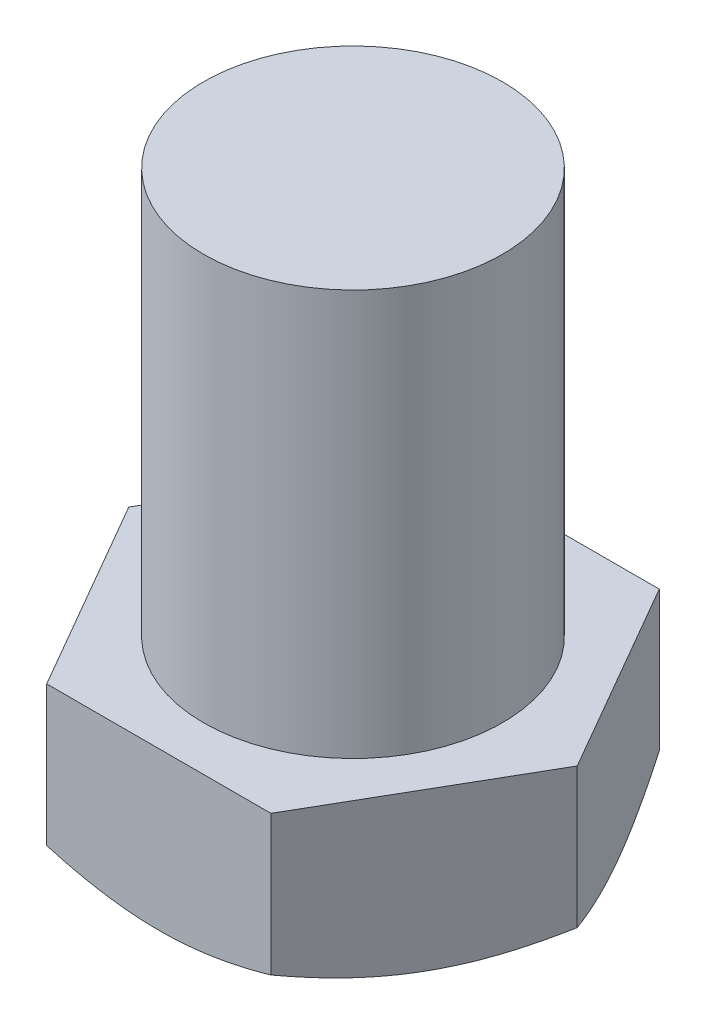
ISO-10303-21;
HEADER;
FILE_DESCRIPTION(('STEP AP214'),'2;1');
FILE_NAME('part.step','',(''),(''),'','','');
FILE_SCHEMA(('AUTOMOTIVE_DESIGN { 1 0 10303 214 1 1 1 1 }'));
ENDSEC;
DATA;
#1=APPLICATION_CONTEXT('core data for automotive mechanical design processes');
#2=APPLICATION_PROTOCOL_DEFINITION('international standard','automotive_design',2000,#1);
#3=PRODUCT_CONTEXT('',#1,'mechanical');
#4=PRODUCT('Part','Part','',(#3));
#5=PRODUCT_RELATED_PRODUCT_CATEGORY('part','',(#4));
#6=PRODUCT_DEFINITION_FORMATION('','',#4);
#7=PRODUCT_DEFINITION_CONTEXT('part definition',#1,'design');
#8=PRODUCT_DEFINITION('design','',#6,#7);
#9=PRODUCT_DEFINITION_SHAPE('','',#8);
#10=(LENGTH_UNIT() NAMED_UNIT(*) SI_UNIT(.MILLI.,.METRE.));
#11=(NAMED_UNIT(*) PLANE_ANGLE_UNIT() SI_UNIT($,.RADIAN.));
#12=(NAMED_UNIT(*) SI_UNIT($,.STERADIAN.) SOLID_ANGLE_UNIT());
#13=UNCERTAINTY_MEASURE_WITH_UNIT(LENGTH_MEASURE(1.E-05),#10,'distance_accuracy_value','');
#14=(GEOMETRIC_REPRESENTATION_CONTEXT(3) GLOBAL_UNCERTAINTY_ASSIGNED_CONTEXT((#13)) GLOBAL_UNIT_ASSIGNED_CONTEXT((#10,
#11,#12)) REPRESENTATION_CONTEXT('',''));
#15=CARTESIAN_POINT('',(0.,0.,0.));
#16=DIRECTION('',(0.,0.,1.));
#17=DIRECTION('',(1.,0.,0.));
#18=AXIS2_PLACEMENT_3D('',#15,#16,#17);
#19=CARTESIAN_POINT('',(5.25000000000011,8.,9.09326673973654));
#20=DIRECTION('',(-0.866025403784442,0.,-0.499999999999995));
#21=DIRECTION('',(-0.499999999999995,0.,0.866025403784442));
#22=AXIS2_PLACEMENT_3D('',#19,#20,#21);
#23=PLANE('',#22);
#24=CARTESIAN_POINT('',(10.5001154700538,1.44344234074043,-0.0002));
#25=CARTESIAN_POINT('',(10.3847280363974,1.37682687218532,0.199656897647865));
#26=CARTESIAN_POINT('',(10.2688905530427,1.31323405726124,0.400293304239121));
#27=CARTESIAN_POINT('',(10.0362748805198,1.19292776158243,0.803195467685742));
#28=CARTESIAN_POINT('',(9.91949630831816,1.13621725027232,1.00546188797426));
#29=CARTESIAN_POINT('',(9.68478175907643,1.03044427532811,1.41199941253658));
#30=CARTESIAN_POINT('',(9.56684370776388,0.981400088436956,1.61627410955557));
#31=CARTESIAN_POINT('',(9.33016546824959,0.89202116489814,2.02621284544028));
#32=CARTESIAN_POINT('',(9.21142544903797,0.851684649005117,2.23187659160653));
#33=CARTESIAN_POINT('',(8.97615382934937,0.781423048193364,2.63937899048619));
#34=CARTESIAN_POINT('',(8.85963960737029,0.751266603117255,2.84118754275833));
#35=CARTESIAN_POINT('',(8.62608983004945,0.700703866502197,3.24570762317442));
#36=CARTESIAN_POINT('',(8.50905432169238,0.680296713495569,3.44841906993852));
#37=CARTESIAN_POINT('',(8.27478030369215,0.649742299330548,3.85419357200824));
#38=CARTESIAN_POINT('',(8.15754217635836,0.639583394767521,4.05725596513459));
#39=CARTESIAN_POINT('',(7.92295802677138,0.629745271822186,4.46356763086958));
#40=CARTESIAN_POINT('',(7.80561200796367,0.63006572966396,4.66681689751046));
#41=CARTESIAN_POINT('',(7.58623013277257,0.640456828448158,5.0467974516012));
#42=CARTESIAN_POINT('',(7.48417880710043,0.649259919582375,5.2235555326451));
#43=CARTESIAN_POINT('',(7.28031519453202,0.674620648234135,5.57665766742814));
#44=CARTESIAN_POINT('',(7.17850292421381,0.691178808468231,5.7530016924532));
#45=CARTESIAN_POINT('',(6.87346026543448,0.752094464347212,6.28135107593491));
#46=CARTESIAN_POINT('',(6.67076981978894,0.807685527995083,6.63242122600177));
#47=CARTESIAN_POINT('',(6.26323886130116,0.946663846216747,7.33828555175986));
#48=CARTESIAN_POINT('',(6.05845035882324,1.03064021587855,7.69298964285756));
#49=CARTESIAN_POINT('',(5.65192725494666,1.22123175560358,8.39710831322241));
#50=CARTESIAN_POINT('',(5.45018744782168,1.32780216165882,8.74653190907203));
#51=CARTESIAN_POINT('',(5.24988452994627,1.44344234074043,9.09346673973655));
#52=B_SPLINE_CURVE_WITH_KNOTS('',3,(#24,#25,#26,#27,#28,#29,#30,#31,#32,#33,#34,#35,#36,#37,#38,
#39,#40,#41,#42,#43,#44,#45,#46,#47,#48,#49,#50,#51),.UNSPECIFIED.,.F.,.F.,(4,2,2,2,2,2,2,2,2,2,
2,2,2,4),(0.,0.720610237681786,1.44153029335,2.16414365920962,2.88660923285365,3.59133223973567,
4.29599296430742,4.99985219370005,5.70368967630656,6.31641406566495,6.9291797605591,
8.15558398123814,9.40918712315733,10.6603294175012),.UNSPECIFIED.);
#53=CARTESIAN_POINT('',(10.5,1.44337567297406,0.));
#54=VERTEX_POINT('',#53);
#55=CARTESIAN_POINT('',(5.25000000000011,1.44337567297406,9.09326673973654));
#56=VERTEX_POINT('',#55);
#57=EDGE_CURVE('E78',#54,#56,#52,.T.);
#58=ORIENTED_EDGE('',*,*,#57,.F.);
#59=DIRECTION('',(0.,-1.,0.));
#60=VECTOR('',#59,1.);
#61=CARTESIAN_POINT('',(10.5,8.,0.));
#62=LINE('',#61,#60);
#63=CARTESIAN_POINT('',(10.5,8.,0.));
#64=VERTEX_POINT('',#63);
#65=EDGE_CURVE('E65',#64,#54,#62,.T.);
#66=ORIENTED_EDGE('',*,*,#65,.F.);
#67=DIRECTION('',(0.499999999999995,0.,-0.866025403784441));
#68=VECTOR('',#67,1.);
#69=CARTESIAN_POINT('',(5.25000000000011,8.,9.09326673973654));
#70=LINE('',#69,#68);
#71=CARTESIAN_POINT('',(5.25000000000011,8.,9.09326673973654));
#72=VERTEX_POINT('',#71);
#73=EDGE_CURVE('E166',#72,#64,#70,.T.);
#74=ORIENTED_EDGE('',*,*,#73,.F.);
#75=DIRECTION('',(0.,-1.,0.));
#76=VECTOR('',#75,1.);
#77=CARTESIAN_POINT('',(5.25000000000011,8.,9.09326673973654));
#78=LINE('',#77,#76);
#79=EDGE_CURVE('E138',#72,#56,#78,.T.);
#80=ORIENTED_EDGE('',*,*,#79,.T.);
#81=EDGE_LOOP('',(#58,#66,#74,#80));
#82=FACE_BOUND('',#81,.T.);
#83=ADVANCED_FACE('F61',(#82),#23,.F.);
#84=CARTESIAN_POINT('',(10.5,8.,0.));
#85=DIRECTION('',(-0.866025403784438,0.,0.500000000000001));
#86=DIRECTION('',(0.500000000000001,0.,0.866025403784438));
#87=AXIS2_PLACEMENT_3D('',#84,#85,#86);
#88=PLANE('',#87);
#89=CARTESIAN_POINT('',(5.24988452994614,1.44344234074043,-9.09346673973662));
#90=CARTESIAN_POINT('',(5.36527196360254,1.37682687218532,-8.89360984208875));
#91=CARTESIAN_POINT('',(5.48110944695724,1.31323405726123,-8.6929734354975));
#92=CARTESIAN_POINT('',(5.71372511948023,1.19292776158243,-8.29007127205088));
#93=CARTESIAN_POINT('',(5.83050369168182,1.13621725027232,-8.08780485176237));
#94=CARTESIAN_POINT('',(6.06521824092356,1.03044427532811,-7.68126732720005));
#95=CARTESIAN_POINT('',(6.18315629223611,0.981400088436949,-7.47699263018106));
#96=CARTESIAN_POINT('',(6.4198345317504,0.892021164898131,-7.06705389429635));
#97=CARTESIAN_POINT('',(6.53857455096203,0.851684649005108,-6.8613901481301));
#98=CARTESIAN_POINT('',(6.77384617065062,0.781423048193353,-6.45388774925043));
#99=CARTESIAN_POINT('',(6.89036039262971,0.751266603117242,-6.2520791969783));
#100=CARTESIAN_POINT('',(7.12391016995055,0.700703866502182,-5.84755911656221));
#101=CARTESIAN_POINT('',(7.24094567830762,0.680296713495553,-5.64484766979811));
#102=CARTESIAN_POINT('',(7.47521969630786,0.64974229933053,-5.23907316772839));
#103=CARTESIAN_POINT('',(7.59245782364165,0.639583394767501,-5.03601077460205));
#104=CARTESIAN_POINT('',(7.82704197322863,0.629745271822165,-4.62969910886706));
#105=CARTESIAN_POINT('',(7.94438799203634,0.630065729663939,-4.42644984222618));
#106=CARTESIAN_POINT('',(8.16376986722744,0.640456828448135,-4.04646928813544));
#107=CARTESIAN_POINT('',(8.26582119289959,0.649259919582351,-3.86971120709153));
#108=CARTESIAN_POINT('',(8.46968480546801,0.674620648234111,-3.51660907230848));
#109=CARTESIAN_POINT('',(8.57149707578622,0.691178808468207,-3.34026504728342));
#110=CARTESIAN_POINT('',(8.87653973456556,0.752094464347189,-2.8119156638017));
#111=CARTESIAN_POINT('',(9.07923018021111,0.807685527995061,-2.46084551373483));
#112=CARTESIAN_POINT('',(9.4867611386989,0.946663846216729,-1.75498118797673));
#113=CARTESIAN_POINT('',(9.69154964117683,1.03064021587854,-1.40027709687902));
#114=CARTESIAN_POINT('',(10.0980727450534,1.22123175560357,-0.69615842651415));
#115=CARTESIAN_POINT('',(10.2998125521784,1.32780216165881,-0.346734830664524));
#116=CARTESIAN_POINT('',(10.5001154700538,1.44344234074043,0.000199999999999366));
#117=B_SPLINE_CURVE_WITH_KNOTS('',3,(#89,#90,#91,#92,#93,#94,#95,#96,#97,#98,#99,#100,#101,#102,
#103,#104,#105,#106,#107,#108,#109,#110,#111,#112,#113,#114,#115,#116),.UNSPECIFIED.,.F.,.F.,(4,
2,2,2,2,2,2,2,2,2,2,2,2,4),(0.,0.720610237681786,1.44153029335,2.16414365920961,
2.88660923285365,3.59133223973567,4.29599296430742,4.99985219370005,5.70368967630655,
6.31641406566497,6.92917976055912,8.15558398123821,9.40918712315743,10.6603294175013),.UNSPECIFIED.);
#118=CARTESIAN_POINT('',(5.24999999999998,1.44337567297406,-9.09326673973662));
#119=VERTEX_POINT('',#118);
#120=EDGE_CURVE('E162',#119,#54,#117,.T.);
#121=ORIENTED_EDGE('',*,*,#120,.F.);
#122=DIRECTION('',(0.,-1.,0.));
#123=VECTOR('',#122,1.);
#124=CARTESIAN_POINT('',(5.24999999999998,8.,-9.09326673973662));
#125=LINE('',#124,#123);
#126=CARTESIAN_POINT('',(5.24999999999998,8.,-9.09326673973662));
#127=VERTEX_POINT('',#126);
#128=EDGE_CURVE('E149',#127,#119,#125,.T.);
#129=ORIENTED_EDGE('',*,*,#128,.F.);
#130=DIRECTION('',(-0.500000000000001,0.,-0.866025403784438));
#131=VECTOR('',#130,1.);
#132=CARTESIAN_POINT('',(10.5,8.,0.));
#133=LINE('',#132,#131);
#134=EDGE_CURVE('E163',#64,#127,#133,.T.);
#135=ORIENTED_EDGE('',*,*,#134,.F.);
#136=ORIENTED_EDGE('',*,*,#65,.T.);
#137=EDGE_LOOP('',(#121,#129,#135,#136));
#138=FACE_BOUND('',#137,.T.);
#139=ADVANCED_FACE('F161',(#138),#88,.F.);
#140=CARTESIAN_POINT('',(5.24999999999998,8.,-9.09326673973662));
#141=DIRECTION('',(0.,0.,1.));
#142=DIRECTION('',(1.,0.,0.));
#143=AXIS2_PLACEMENT_3D('',#140,#141,#142);
#144=PLANE('',#143);
#145=CARTESIAN_POINT('',(-15.8568017177983,5.93464374055897,-9.09326673973655));
#146=CARTESIAN_POINT('',(-15.4777364124602,5.74482170590247,-9.09326673973655));
#147=CARTESIAN_POINT('',(-15.0980138564525,5.55629845755843,-9.09326673973655));
#148=CARTESIAN_POINT('',(-14.3369541703648,5.18247781066019,-9.09326673973655));
#149=CARTESIAN_POINT('',(-13.9556169353322,4.99718062592639,-9.09326673973655));
#150=CARTESIAN_POINT('',(-13.1903133591447,4.63009895014826,-9.09326673973656));
#151=CARTESIAN_POINT('',(-12.8063432853983,4.44832222463283,-9.09326673973656));
#152=CARTESIAN_POINT('',(-12.0361866852404,4.08953685039794,-9.09326673973656));
#153=CARTESIAN_POINT('',(-11.6500002020573,3.91252810906514,-9.09326673973656));
#154=CARTESIAN_POINT('',(-10.8574379772101,3.55649948222727,-9.09326673973657));
#155=CARTESIAN_POINT('',(-10.4509397690009,3.37775136706856,-9.09326673973657));
#156=CARTESIAN_POINT('',(-9.63445791129913,3.02831397181417,-9.09326673973657));
#157=CARTESIAN_POINT('',(-9.22447410744563,2.85762505083997,-9.09326673973657));
#158=CARTESIAN_POINT('',(-8.40062142990758,2.52660354932188,-9.09326673973657));
#159=CARTESIAN_POINT('',(-7.98675511514473,2.36626463059457,-9.09326673973657));
#160=CARTESIAN_POINT('',(-7.15417900917262,2.05870629750028,-9.09326673973658));
#161=CARTESIAN_POINT('',(-6.73546975238089,1.91148545087132,-9.09326673973658));
#162=CARTESIAN_POINT('',(-6.05438911677562,1.6872212183649,-9.09326673973658));
#163=CARTESIAN_POINT('',(-5.79374628503091,1.60494376218121,-9.09326673973658));
#164=CARTESIAN_POINT('',(-5.27022683837007,1.44784792754185,-9.09326673973658));
#165=CARTESIAN_POINT('',(-5.00735013956236,1.37302983057358,-9.09326673973658));
#166=CARTESIAN_POINT('',(-4.21519936295703,1.16151938941166,-9.09326673973658));
#167=CARTESIAN_POINT('',(-3.68229899487151,1.03773515583713,-9.09326673973659));
#168=CARTESIAN_POINT('',(-2.88122543782077,0.886549497272969,-9.09326673973659));
#169=CARTESIAN_POINT('',(-2.61621039594772,0.842142312210883,-9.09326673973659));
#170=CARTESIAN_POINT('',(-2.08442507158447,0.765313297557984,-9.09326673973659));
#171=CARTESIAN_POINT('',(-1.81765481972577,0.732891259366928,-9.09326673973659));
#172=CARTESIAN_POINT('',(-1.28294446976282,0.681010053298244,-9.0932667397366));
#173=CARTESIAN_POINT('',(-1.01500482588357,0.661546237177771,-9.0932667397366));
#174=CARTESIAN_POINT('',(-0.478477900411162,0.636194579917962,-9.0932667397366));
#175=CARTESIAN_POINT('',(-0.20989062180452,0.630306676293746,-9.0932667397366));
#176=CARTESIAN_POINT('',(0.328914518301501,0.63231383766897,-9.0932667397366));
#177=CARTESIAN_POINT('',(0.599132057780456,0.640295448199443,-9.0932667397366));
#178=CARTESIAN_POINT('',(1.13880835726805,0.669934728458221,-9.0932667397366));
#179=CARTESIAN_POINT('',(1.40826711390522,0.691592458857034,-9.0932667397366));
#180=CARTESIAN_POINT('',(1.94591810899649,0.747890203381434,-9.0932667397366));
#181=CARTESIAN_POINT('',(2.21410982944007,0.782535128464169,-9.09326673973661));
#182=CARTESIAN_POINT('',(2.74865727346096,0.863779241691202,-9.09326673973661));
#183=CARTESIAN_POINT('',(3.01501293258054,0.910378847349959,-9.09326673973661));
#184=CARTESIAN_POINT('',(3.81993504542777,1.06807554146351,-9.09326673973661));
#185=CARTESIAN_POINT('',(4.35524380949231,1.19604673827171,-9.09326673973661));
#186=CARTESIAN_POINT('',(5.15107921164002,1.41351118526861,-9.09326673973662));
#187=CARTESIAN_POINT('',(5.41525940850246,1.49028142442693,-9.09326673973662));
#188=CARTESIAN_POINT('',(5.94137656982224,1.65117159318865,-9.09326673973662));
#189=CARTESIAN_POINT('',(6.20331361897731,1.73529124393431,-9.09326673973662));
#190=CARTESIAN_POINT('',(6.87860515094579,1.96117826168478,-9.09326673973662));
#191=CARTESIAN_POINT('',(7.29035153222695,2.10773795819795,-9.09326673973662));
#192=CARTESIAN_POINT('',(8.10906886025213,2.41319627599115,-9.09326673973663));
#193=CARTESIAN_POINT('',(8.51604109413459,2.57209147924274,-9.09326673973663));
#194=CARTESIAN_POINT('',(9.32631868973301,2.89970939825599,-9.09326673973663));
#195=CARTESIAN_POINT('',(9.72962133176085,3.06843880977679,-9.09326673973663));
#196=CARTESIAN_POINT('',(10.5329347856138,3.41359619641427,-9.09326673973663));
#197=CARTESIAN_POINT('',(10.9329453919563,3.59002464782289,-9.09326673973664));
#198=CARTESIAN_POINT('',(11.7131335487981,3.94133815688118,-9.09326673973664));
#199=CARTESIAN_POINT('',(12.0934272222302,4.11596610527271,-9.09326673973664));
#200=CARTESIAN_POINT('',(12.8518671391847,4.46980104928979,-9.09326673973664));
#201=CARTESIAN_POINT('',(13.2300134160753,4.64900797352371,-9.09326673973664));
#202=CARTESIAN_POINT('',(13.9838118758652,5.01085039936679,-9.09326673973665));
#203=CARTESIAN_POINT('',(14.3594673450861,5.19347906866654,-9.09326673973665));
#204=CARTESIAN_POINT('',(15.1092285929885,5.56186571686167,-9.09326673973665));
#205=CARTESIAN_POINT('',(15.4833344152204,5.7476236070617,-9.09326673973665));
#206=CARTESIAN_POINT('',(15.8568017177982,5.93464374055897,-9.09326673973665));
#207=B_SPLINE_CURVE_WITH_KNOTS('',3,(#145,#146,#147,#148,#149,#150,#151,#152,#153,#154,#155,
#156,#157,#158,#159,#160,#161,#162,#163,#164,#165,#166,#167,#168,#169,#170,#171,#172,#173,#174,
#175,#176,#177,#178,#179,#180,#181,#182,#183,#184,#185,#186,#187,#188,#189,#190,#191,#192,#193,
#194,#195,#196,#197,#198,#199,#200,#201,#202,#203,#204,#205,#206),.UNSPECIFIED.,.F.,.F.,(4,2,2,
2,2,2,2,2,2,2,2,2,2,2,2,2,2,2,2,2,2,2,2,2,2,2,2,2,2,2,4),(0.,1.27181882794577,2.54372163236151,
3.81816792926679,5.09258945344864,6.42470930699005,7.75688846450623,9.088243920992,
10.4194538383845,11.2393092064373,12.059195500965,13.6986340933554,14.5045443141962,
15.3104405075923,16.1160474620452,16.9216507085812,17.7322989741067,18.5429508358853,
19.3539095459927,20.1648965825026,21.8142925353454,22.6395587217523,23.4647936087831,
24.7756792986225,26.0862030445968,27.3976297460598,28.709137692711,29.9645152450235,
31.2198732364494,32.4729468782191,33.7259850621419),.UNSPECIFIED.);
#208=CARTESIAN_POINT('',(-5.25000000000004,1.44337567297406,-9.09326673973658));
#209=VERTEX_POINT('',#208);
#210=EDGE_CURVE('E174',#209,#119,#207,.T.);
#211=ORIENTED_EDGE('',*,*,#210,.F.);
#212=DIRECTION('',(0.,-1.,0.));
#213=VECTOR('',#212,1.);
#214=CARTESIAN_POINT('',(-5.25000000000004,8.,-9.09326673973658));
#215=LINE('',#214,#213);
#216=CARTESIAN_POINT('',(-5.25000000000004,8.,-9.09326673973658));
#217=VERTEX_POINT('',#216);
#218=EDGE_CURVE('E142',#217,#209,#215,.T.);
#219=ORIENTED_EDGE('',*,*,#218,.F.);
#220=DIRECTION('',(-1.,0.,0.));
#221=VECTOR('',#220,1.);
#222=CARTESIAN_POINT('',(5.24999999999998,8.,-9.09326673973662));
#223=LINE('',#222,#221);
#224=EDGE_CURVE('E317',#127,#217,#223,.T.);
#225=ORIENTED_EDGE('',*,*,#224,.F.);
#226=ORIENTED_EDGE('',*,*,#128,.T.);
#227=EDGE_LOOP('',(#211,#219,#225,#226));
#228=FACE_BOUND('',#227,.T.);
#229=ADVANCED_FACE('F221',(#228),#144,.F.);
#230=CARTESIAN_POINT('',(-5.25000000000004,8.,-9.09326673973658));
#231=DIRECTION('',(0.866025403784441,0.,0.499999999999995));
#232=DIRECTION('',(0.499999999999995,0.,-0.866025403784442));
#233=AXIS2_PLACEMENT_3D('',#230,#231,#232);
#234=PLANE('',#233);
#235=CARTESIAN_POINT('',(-10.5001154700538,1.44344234074043,0.000200000000073321));
#236=CARTESIAN_POINT('',(-10.3847280363974,1.37682687218532,-0.19965689764779));
#237=CARTESIAN_POINT('',(-10.2688905530427,1.31323405726123,-0.400293304239046));
#238=CARTESIAN_POINT('',(-10.0362748805198,1.19292776158243,-0.803195467685668));
#239=CARTESIAN_POINT('',(-9.91949630831816,1.13621725027232,-1.00546188797418));
#240=CARTESIAN_POINT('',(-9.68478175907643,1.03044427532811,-1.4119994125365));
#241=CARTESIAN_POINT('',(-9.56684370776388,0.981400088436948,-1.61627410955549));
#242=CARTESIAN_POINT('',(-9.33016546824959,0.89202116489813,-2.0262128454402));
#243=CARTESIAN_POINT('',(-9.21142544903796,0.851684649005107,-2.23187659160645));
#244=CARTESIAN_POINT('',(-8.97615382934937,0.781423048193353,-2.63937899048612));
#245=CARTESIAN_POINT('',(-8.85963960737029,0.751266603117242,-2.84118754275825));
#246=CARTESIAN_POINT('',(-8.62608983004945,0.700703866502182,-3.24570762317435));
#247=CARTESIAN_POINT('',(-8.50905432169239,0.680296713495553,-3.44841906993844));
#248=CARTESIAN_POINT('',(-8.27478030369215,0.649742299330529,-3.85419357200816));
#249=CARTESIAN_POINT('',(-8.15754217635836,0.6395833947675,-4.05725596513451));
#250=CARTESIAN_POINT('',(-7.92295802677138,0.629745271822164,-4.46356763086951));
#251=CARTESIAN_POINT('',(-7.80561200796368,0.630065729663938,-4.66681689751039));
#252=CARTESIAN_POINT('',(-7.58623013277257,0.640456828448134,-5.04679745160112));
#253=CARTESIAN_POINT('',(-7.48417880710043,0.64925991958235,-5.22355553264503));
#254=CARTESIAN_POINT('',(-7.28031519453201,0.674620648234109,-5.57665766742808));
#255=CARTESIAN_POINT('',(-7.1785029242138,0.691178808468206,-5.75300169245315));
#256=CARTESIAN_POINT('',(-6.87346026543446,0.752094464347188,-6.28135107593487));
#257=CARTESIAN_POINT('',(-6.67076981978892,0.80768552799506,-6.63242122600174));
#258=CARTESIAN_POINT('',(-6.26323886130112,0.946663846216728,-7.33828555175985));
#259=CARTESIAN_POINT('',(-6.0584503588232,1.03064021587854,-7.69298964285756));
#260=CARTESIAN_POINT('',(-5.65192725494661,1.22123175560357,-8.39710831322243));
#261=CARTESIAN_POINT('',(-5.45018744782162,1.32780216165881,-8.74653190907206));
#262=CARTESIAN_POINT('',(-5.2498845299462,1.44344234074043,-9.09346673973658));
#263=B_SPLINE_CURVE_WITH_KNOTS('',3,(#235,#236,#237,#238,#239,#240,#241,#242,#243,#244,#245,
#246,#247,#248,#249,#250,#251,#252,#253,#254,#255,#256,#257,#258,#259,#260,#261,#262),
.UNSPECIFIED.,.F.,.F.,(4,2,2,2,2,2,2,2,2,2,2,2,2,4),(0.,0.720610237681786,1.44153029335,
2.16414365920961,2.88660923285365,3.59133223973567,4.29599296430742,4.99985219370005,
5.70368967630655,6.31641406566497,6.92917976055913,8.15558398123821,9.40918712315743,
10.6603294175013),.UNSPECIFIED.);
#264=CARTESIAN_POINT('',(-10.5,1.44337567297406,0.));
#265=VERTEX_POINT('',#264);
#266=EDGE_CURVE('E134',#265,#209,#263,.T.);
#267=ORIENTED_EDGE('',*,*,#266,.F.);
#268=DIRECTION('',(0.,-1.,0.));
#269=VECTOR('',#268,1.);
#270=CARTESIAN_POINT('',(-10.5,8.,0.));
#271=LINE('',#270,#269);
#272=CARTESIAN_POINT('',(-10.5,8.,0.));
#273=VERTEX_POINT('',#272);
#274=EDGE_CURVE('E132',#273,#265,#271,.T.);
#275=ORIENTED_EDGE('',*,*,#274,.F.);
#276=DIRECTION('',(-0.499999999999995,0.,0.866025403784441));
#277=VECTOR('',#276,1.);
#278=CARTESIAN_POINT('',(-5.25000000000004,8.,-9.09326673973658));
#279=LINE('',#278,#277);
#280=EDGE_CURVE('E318',#217,#273,#279,.T.);
#281=ORIENTED_EDGE('',*,*,#280,.F.);
#282=ORIENTED_EDGE('',*,*,#218,.T.);
#283=EDGE_LOOP('',(#267,#275,#281,#282));
#284=FACE_BOUND('',#283,.T.);
#285=ADVANCED_FACE('F224',(#284),#234,.F.);
#286=CARTESIAN_POINT('',(-10.5,8.,0.));
#287=DIRECTION('',(0.866025403784435,0.,-0.500000000000007));
#288=DIRECTION('',(-0.500000000000007,0.,-0.866025403784435));
#289=AXIS2_PLACEMENT_3D('',#286,#287,#288);
#290=PLANE('',#289);
#291=CARTESIAN_POINT('',(-5.24988452994608,1.44344234074043,9.09346673973666));
#292=CARTESIAN_POINT('',(-5.36527196360248,1.37682687218532,8.89360984208879));
#293=CARTESIAN_POINT('',(-5.48110944695718,1.31323405726124,8.69297343549754));
#294=CARTESIAN_POINT('',(-5.71372511948017,1.19292776158243,8.29007127205092));
#295=CARTESIAN_POINT('',(-5.83050369168177,1.13621725027232,8.08780485176241));
#296=CARTESIAN_POINT('',(-6.06521824092351,1.03044427532811,7.68126732720009));
#297=CARTESIAN_POINT('',(-6.18315629223605,0.981400088436949,7.4769926301811));
#298=CARTESIAN_POINT('',(-6.41983453175035,0.892021164898132,7.0670538942964));
#299=CARTESIAN_POINT('',(-6.53857455096198,0.851684649005109,6.86139014813015));
#300=CARTESIAN_POINT('',(-6.77384617065058,0.781423048193353,6.45388774925048));
#301=CARTESIAN_POINT('',(-6.89036039262967,0.751266603117242,6.25207919697835));
#302=CARTESIAN_POINT('',(-7.12391016995051,0.700703866502183,5.84755911656226));
#303=CARTESIAN_POINT('',(-7.24094567830758,0.680296713495554,5.64484766979817));
#304=CARTESIAN_POINT('',(-7.47521969630782,0.649742299330531,5.23907316772845));
#305=CARTESIAN_POINT('',(-7.59245782364161,0.639583394767501,5.0360107746021));
#306=CARTESIAN_POINT('',(-7.8270419732286,0.629745271822165,4.62969910886711));
#307=CARTESIAN_POINT('',(-7.9443879920363,0.630065729663939,4.42644984222623));
#308=CARTESIAN_POINT('',(-8.16376986722741,0.640456828448136,4.0464692881355));
#309=CARTESIAN_POINT('',(-8.26582119289956,0.649259919582351,3.86971120709159));
#310=CARTESIAN_POINT('',(-8.46968480546798,0.67462064823411,3.51660907230854));
#311=CARTESIAN_POINT('',(-8.57149707578619,0.691178808468207,3.34026504728348));
#312=CARTESIAN_POINT('',(-8.87653973456554,0.752094464347189,2.81191566380176));
#313=CARTESIAN_POINT('',(-9.07923018021109,0.80768552799506,2.4608455137349));
#314=CARTESIAN_POINT('',(-9.48676113869889,0.946663846216728,1.75498118797679));
#315=CARTESIAN_POINT('',(-9.69154964117682,1.03064021587853,1.40027709687908));
#316=CARTESIAN_POINT('',(-10.0980727450534,1.22123175560357,0.696158426514222));
#317=CARTESIAN_POINT('',(-10.2998125521784,1.32780216165881,0.346734830664597));
#318=CARTESIAN_POINT('',(-10.5001154700538,1.44344234074042,-0.000199999999925938));
#319=B_SPLINE_CURVE_WITH_KNOTS('',3,(#291,#292,#293,#294,#295,#296,#297,#298,#299,#300,#301,
#302,#303,#304,#305,#306,#307,#308,#309,#310,#311,#312,#313,#314,#315,#316,#317,#318),
.UNSPECIFIED.,.F.,.F.,(4,2,2,2,2,2,2,2,2,2,2,2,2,4),(0.,0.720610237681785,1.44153029335,
2.16414365920961,2.88660923285365,3.59133223973567,4.29599296430742,4.99985219370005,
5.70368967630655,6.31641406566497,6.92917976055913,8.15558398123821,9.40918712315743,
10.6603294175013),.UNSPECIFIED.);
#320=CARTESIAN_POINT('',(-5.24999999999992,1.44337567297406,9.09326673973665));
#321=VERTEX_POINT('',#320);
#322=EDGE_CURVE('E117',#321,#265,#319,.T.);
#323=ORIENTED_EDGE('',*,*,#322,.F.);
#324=DIRECTION('',(0.,-1.,0.));
#325=VECTOR('',#324,1.);
#326=CARTESIAN_POINT('',(-5.24999999999992,8.,9.09326673973665));
#327=LINE('',#326,#325);
#328=CARTESIAN_POINT('',(-5.24999999999992,8.,9.09326673973665));
#329=VERTEX_POINT('',#328);
#330=EDGE_CURVE('E130',#329,#321,#327,.T.);
#331=ORIENTED_EDGE('',*,*,#330,.F.);
#332=DIRECTION('',(0.500000000000007,0.,0.866025403784435));
#333=VECTOR('',#332,1.);
#334=CARTESIAN_POINT('',(-10.5,8.,0.));
#335=LINE('',#334,#333);
#336=EDGE_CURVE('E320',#273,#329,#335,.T.);
#337=ORIENTED_EDGE('',*,*,#336,.F.);
#338=ORIENTED_EDGE('',*,*,#274,.T.);
#339=EDGE_LOOP('',(#323,#331,#337,#338));
#340=FACE_BOUND('',#339,.T.);
#341=ADVANCED_FACE('F128',(#340),#290,.F.);
#342=CARTESIAN_POINT('',(-5.24999999999992,8.,9.09326673973665));
#343=DIRECTION('',(0.,0.,-1.));
#344=DIRECTION('',(-1.,0.,0.));
#345=AXIS2_PLACEMENT_3D('',#342,#343,#344);
#346=PLANE('',#345);
#347=CARTESIAN_POINT('',(15.8568017177983,5.93464374055897,9.09326673973643));
#348=CARTESIAN_POINT('',(15.4777364124603,5.74482170590247,9.09326673973643));
#349=CARTESIAN_POINT('',(15.0980138564525,5.55629845755843,9.09326673973644));
#350=CARTESIAN_POINT('',(14.3369541703649,5.18247781066019,9.09326673973645));
#351=CARTESIAN_POINT('',(13.9556169353323,4.99718062592639,9.09326673973645));
#352=CARTESIAN_POINT('',(13.1903133591448,4.63009895014826,9.09326673973646));
#353=CARTESIAN_POINT('',(12.8063432853984,4.44832222463283,9.09326673973646));
#354=CARTESIAN_POINT('',(12.0361866852404,4.08953685039794,9.09326673973647));
#355=CARTESIAN_POINT('',(11.6500002020574,3.91252810906514,9.09326673973648));
#356=CARTESIAN_POINT('',(10.8574379772102,3.55649948222727,9.09326673973649));
#357=CARTESIAN_POINT('',(10.4509397690009,3.37775136706856,9.09326673973649));
#358=CARTESIAN_POINT('',(9.6344579112992,3.02831397181417,9.0932667397365));
#359=CARTESIAN_POINT('',(9.2244741074457,2.85762505083997,9.0932667397365));
#360=CARTESIAN_POINT('',(8.40062142990765,2.52660354932188,9.09326673973651));
#361=CARTESIAN_POINT('',(7.9867551151448,2.36626463059457,9.09326673973651));
#362=CARTESIAN_POINT('',(7.15417900917269,2.05870629750028,9.09326673973652));
#363=CARTESIAN_POINT('',(6.73546975238096,1.91148545087132,9.09326673973653));
#364=CARTESIAN_POINT('',(6.05438911677569,1.6872212183649,9.09326673973653));
#365=CARTESIAN_POINT('',(5.79374628503098,1.60494376218122,9.09326673973654));
#366=CARTESIAN_POINT('',(5.27022683837014,1.44784792754185,9.09326673973654));
#367=CARTESIAN_POINT('',(5.00735013956243,1.37302983057358,9.09326673973655));
#368=CARTESIAN_POINT('',(4.2151993629571,1.16151938941166,9.09326673973655));
#369=CARTESIAN_POINT('',(3.68229899487158,1.03773515583713,9.09326673973656));
#370=CARTESIAN_POINT('',(2.88122543782084,0.886549497272969,9.09326673973657));
#371=CARTESIAN_POINT('',(2.61621039594779,0.842142312210882,9.09326673973657));
#372=CARTESIAN_POINT('',(2.08442507158454,0.765313297557984,9.09326673973658));
#373=CARTESIAN_POINT('',(1.81765481972584,0.732891259366928,9.09326673973658));
#374=CARTESIAN_POINT('',(1.28294446976288,0.681010053298244,9.09326673973658));
#375=CARTESIAN_POINT('',(1.01500482588364,0.661546237177771,9.09326673973659));
#376=CARTESIAN_POINT('',(0.478477900411229,0.636194579917962,9.09326673973659));
#377=CARTESIAN_POINT('',(0.209890621804588,0.630306676293745,9.0932667397366));
#378=CARTESIAN_POINT('',(-0.328914518301433,0.632313837668969,9.0932667397366));
#379=CARTESIAN_POINT('',(-0.599132057780388,0.640295448199443,9.0932667397366));
#380=CARTESIAN_POINT('',(-1.13880835726798,0.669934728458221,9.09326673973661));
#381=CARTESIAN_POINT('',(-1.40826711390515,0.691592458857034,9.09326673973661));
#382=CARTESIAN_POINT('',(-1.94591810899641,0.747890203381434,9.09326673973662));
#383=CARTESIAN_POINT('',(-2.21410982944,0.782535128464168,9.09326673973662));
#384=CARTESIAN_POINT('',(-2.74865727346089,0.8637792416912,9.09326673973663));
#385=CARTESIAN_POINT('',(-3.01501293258047,0.910378847349958,9.09326673973663));
#386=CARTESIAN_POINT('',(-3.8199350454277,1.06807554146351,9.09326673973664));
#387=CARTESIAN_POINT('',(-4.35524380949224,1.19604673827171,9.09326673973665));
#388=CARTESIAN_POINT('',(-5.15107921163995,1.41351118526861,9.09326673973665));
#389=CARTESIAN_POINT('',(-5.41525940850239,1.49028142442693,9.09326673973666));
#390=CARTESIAN_POINT('',(-5.94137656982217,1.65117159318865,9.09326673973666));
#391=CARTESIAN_POINT('',(-6.20331361897724,1.73529124393431,9.09326673973666));
#392=CARTESIAN_POINT('',(-6.87860515094572,1.96117826168478,9.09326673973667));
#393=CARTESIAN_POINT('',(-7.29035153222689,2.10773795819795,9.09326673973668));
#394=CARTESIAN_POINT('',(-8.10906886025207,2.41319627599115,9.09326673973669));
#395=CARTESIAN_POINT('',(-8.51604109413453,2.57209147924275,9.09326673973669));
#396=CARTESIAN_POINT('',(-9.32631868973294,2.89970939825599,9.0932667397367));
#397=CARTESIAN_POINT('',(-9.72962133176078,3.06843880977679,9.0932667397367));
#398=CARTESIAN_POINT('',(-10.5329347856137,3.41359619641427,9.09326673973671));
#399=CARTESIAN_POINT('',(-10.9329453919562,3.59002464782289,9.09326673973672));
#400=CARTESIAN_POINT('',(-11.713133548798,3.94133815688118,9.09326673973672));
#401=CARTESIAN_POINT('',(-12.0934272222302,4.11596610527272,9.09326673973673));
#402=CARTESIAN_POINT('',(-12.8518671391846,4.4698010492898,9.09326673973673));
#403=CARTESIAN_POINT('',(-13.2300134160752,4.64900797352372,9.09326673973674));
#404=CARTESIAN_POINT('',(-13.9838118758652,5.01085039936679,9.09326673973675));
#405=CARTESIAN_POINT('',(-14.359467345086,5.19347906866654,9.09326673973675));
#406=CARTESIAN_POINT('',(-15.1092285929884,5.56186571686168,9.09326673973676));
#407=CARTESIAN_POINT('',(-15.4833344152203,5.7476236070617,9.09326673973676));
#408=CARTESIAN_POINT('',(-15.8568017177982,5.93464374055897,9.09326673973677));
#409=B_SPLINE_CURVE_WITH_KNOTS('',3,(#347,#348,#349,#350,#351,#352,#353,#354,#355,#356,#357,
#358,#359,#360,#361,#362,#363,#364,#365,#366,#367,#368,#369,#370,#371,#372,#373,#374,#375,#376,
#377,#378,#379,#380,#381,#382,#383,#384,#385,#386,#387,#388,#389,#390,#391,#392,#393,#394,#395,
#396,#397,#398,#399,#400,#401,#402,#403,#404,#405,#406,#407,#408),.UNSPECIFIED.,.F.,.F.,(4,2,2,
2,2,2,2,2,2,2,2,2,2,2,2,2,2,2,2,2,2,2,2,2,2,2,2,2,2,2,4),(0.,1.27181882794578,2.54372163236151,
3.81816792926679,5.09258945344864,6.42470930699005,7.75688846450622,9.08824392099199,
10.4194538383845,11.2393092064373,12.059195500965,13.6986340933554,14.5045443141962,
15.3104405075923,16.1160474620452,16.9216507085812,17.7322989741067,18.5429508358853,
19.3539095459927,20.1648965825026,21.8142925353454,22.6395587217523,23.4647936087831,
24.7756792986225,26.0862030445968,27.3976297460598,28.7091376927111,29.9645152450235,
31.2198732364494,32.4729468782191,33.7259850621419),.UNSPECIFIED.);
#410=EDGE_CURVE('E114',#56,#321,#409,.T.);
#411=ORIENTED_EDGE('',*,*,#410,.F.);
#412=ORIENTED_EDGE('',*,*,#79,.F.);
#413=DIRECTION('',(1.,0.,0.));
#414=VECTOR('',#413,1.);
#415=CARTESIAN_POINT('',(-5.24999999999992,8.,9.09326673973665));
#416=LINE('',#415,#414);
#417=EDGE_CURVE('E86',#329,#72,#416,.T.);
#418=ORIENTED_EDGE('',*,*,#417,.F.);
#419=ORIENTED_EDGE('',*,*,#330,.T.);
#420=EDGE_LOOP('',(#411,#412,#418,#419));
#421=FACE_BOUND('',#420,.T.);
#422=ADVANCED_FACE('F136',(#421),#346,.F.);
#423=CARTESIAN_POINT('',(0.,8.,0.));
#424=DIRECTION('',(0.,1.,0.));
#425=DIRECTION('',(0.,0.,1.));
#426=AXIS2_PLACEMENT_3D('',#423,#424,#425);
#427=PLANE('',#426);
#428=CARTESIAN_POINT('',(0.,8.,0.));
#429=DIRECTION('',(0.,1.,0.));
#430=DIRECTION('',(0.,0.,1.));
#431=AXIS2_PLACEMENT_3D('',#428,#429,#430);
#432=CIRCLE('',#431,7.);
#433=CARTESIAN_POINT('',(0.,8.,7.));
#434=VERTEX_POINT('',#433);
#435=EDGE_CURVE('E13',#434,#434,#432,.T.);
#436=ORIENTED_EDGE('',*,*,#435,.F.);
#437=EDGE_LOOP('',(#436));
#438=FACE_BOUND('',#437,.T.);
#439=ORIENTED_EDGE('',*,*,#73,.T.);
#440=ORIENTED_EDGE('',*,*,#134,.T.);
#441=ORIENTED_EDGE('',*,*,#224,.T.);
#442=ORIENTED_EDGE('',*,*,#280,.T.);
#443=ORIENTED_EDGE('',*,*,#336,.T.);
#444=ORIENTED_EDGE('',*,*,#417,.T.);
#445=EDGE_LOOP('',(#439,#440,#441,#442,#443,#444));
#446=FACE_BOUND('',#445,.T.);
#447=ADVANCED_FACE('F249',(#438,#446),#427,.T.);
#448=CARTESIAN_POINT('',(0.,27.,0.));
#449=DIRECTION('',(0.,-1.,0.));
#450=DIRECTION('',(0.,0.,-1.));
#451=AXIS2_PLACEMENT_3D('',#448,#449,#450);
#452=CYLINDRICAL_SURFACE('',#451,7.);
#453=CARTESIAN_POINT('',(0.,27.,0.));
#454=DIRECTION('',(0.,1.,0.));
#455=DIRECTION('',(0.,0.,1.));
#456=AXIS2_PLACEMENT_3D('',#453,#454,#455);
#457=CIRCLE('',#456,7.);
#458=CARTESIAN_POINT('',(0.,27.,7.));
#459=VERTEX_POINT('',#458);
#460=EDGE_CURVE('E168',#459,#459,#457,.T.);
#461=ORIENTED_EDGE('',*,*,#460,.F.);
#462=EDGE_LOOP('',(#461));
#463=FACE_BOUND('',#462,.T.);
#464=ORIENTED_EDGE('',*,*,#435,.T.);
#465=EDGE_LOOP('',(#464));
#466=FACE_BOUND('',#465,.T.);
#467=ADVANCED_FACE('F240',(#463,#466),#452,.T.);
#468=CARTESIAN_POINT('',(0.,27.,0.));
#469=DIRECTION('',(0.,1.,0.));
#470=DIRECTION('',(0.,0.,1.));
#471=AXIS2_PLACEMENT_3D('',#468,#469,#470);
#472=PLANE('',#471);
#473=ORIENTED_EDGE('',*,*,#460,.T.);
#474=EDGE_LOOP('',(#473));
#475=FACE_BOUND('',#474,.T.);
#476=ADVANCED_FACE('F190',(#475),#472,.T.);
#477=CARTESIAN_POINT('',(0.,0.,0.));
#478=DIRECTION('',(0.,1.,0.));
#479=DIRECTION('',(0.,0.,-1.));
#480=AXIS2_PLACEMENT_3D('',#477,#478,#479);
#481=CONICAL_SURFACE('',#480,8.,1.0471975511966);
#482=CARTESIAN_POINT('',(0.,0.,0.));
#483=DIRECTION('',(0.,-1.,0.));
#484=DIRECTION('',(0.,0.,-1.));
#485=AXIS2_PLACEMENT_3D('',#482,#483,#484);
#486=CIRCLE('',#485,8.);
#487=CARTESIAN_POINT('',(0.,0.,-8.));
#488=VERTEX_POINT('',#487);
#489=EDGE_CURVE('E123',#488,#488,#486,.T.);
#490=ORIENTED_EDGE('',*,*,#489,.F.);
#491=EDGE_LOOP('',(#490));
#492=FACE_BOUND('',#491,.T.);
#493=ORIENTED_EDGE('',*,*,#57,.T.);
#494=ORIENTED_EDGE('',*,*,#410,.T.);
#495=ORIENTED_EDGE('',*,*,#322,.T.);
#496=ORIENTED_EDGE('',*,*,#266,.T.);
#497=ORIENTED_EDGE('',*,*,#210,.T.);
#498=ORIENTED_EDGE('',*,*,#120,.T.);
#499=EDGE_LOOP('',(#493,#494,#495,#496,#497,#498));
#500=FACE_BOUND('',#499,.T.);
#501=ADVANCED_FACE('F116',(#492,#500),#481,.T.);
#502=CARTESIAN_POINT('',(0.,0.,0.));
#503=DIRECTION('',(0.,1.,0.));
#504=DIRECTION('',(0.,0.,1.));
#505=AXIS2_PLACEMENT_3D('',#502,#503,#504);
#506=PLANE('',#505);
#507=ORIENTED_EDGE('',*,*,#489,.T.);
#508=EDGE_LOOP('',(#507));
#509=FACE_BOUND('',#508,.T.);
#510=ADVANCED_FACE('F189',(#509),#506,.F.);
#511=CLOSED_SHELL('',(#83,#139,#229,#285,#341,#422,#447,#467,#476,#501,#510));
#512=MANIFOLD_SOLID_BREP('B2',#511);
#513=ADVANCED_BREP_SHAPE_REPRESENTATION('',(#18,#512),#14);
#514=SHAPE_DEFINITION_REPRESENTATION(#9,#513);
ENDSEC;
END-ISO-10303-21;
